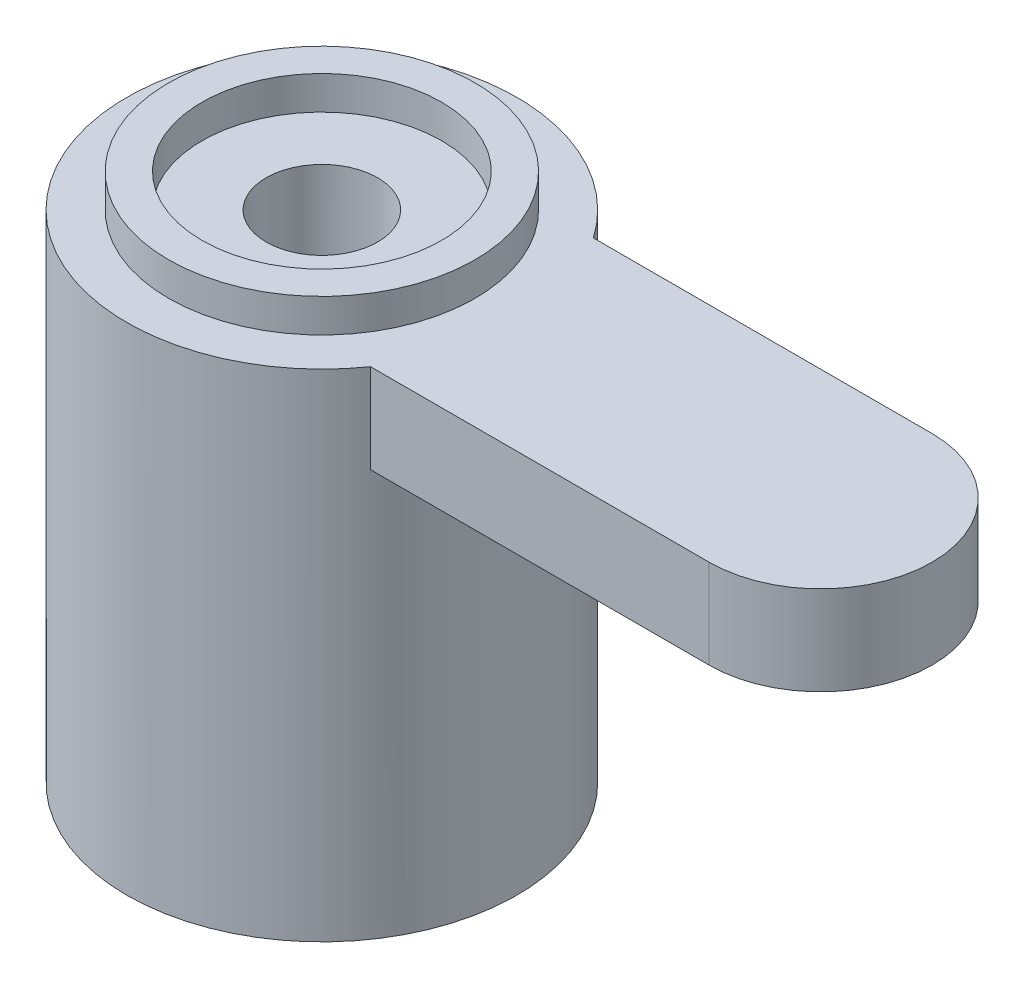
ISO-10303-21;
HEADER;
FILE_DESCRIPTION(('STEP AP214'),'2;1');
FILE_NAME('part.step','',(''),(''),'','','');
FILE_SCHEMA(('AUTOMOTIVE_DESIGN { 1 0 10303 214 1 1 1 1 }'));
ENDSEC;
DATA;
#1=APPLICATION_CONTEXT('core data for automotive mechanical design processes');
#2=APPLICATION_PROTOCOL_DEFINITION('international standard','automotive_design',2000,#1);
#3=PRODUCT_CONTEXT('',#1,'mechanical');
#4=PRODUCT('Part','Part','',(#3));
#5=PRODUCT_RELATED_PRODUCT_CATEGORY('part','',(#4));
#6=PRODUCT_DEFINITION_FORMATION('','',#4);
#7=PRODUCT_DEFINITION_CONTEXT('part definition',#1,'design');
#8=PRODUCT_DEFINITION('design','',#6,#7);
#9=PRODUCT_DEFINITION_SHAPE('','',#8);
#10=(LENGTH_UNIT() NAMED_UNIT(*) SI_UNIT(.MILLI.,.METRE.));
#11=(NAMED_UNIT(*) PLANE_ANGLE_UNIT() SI_UNIT($,.RADIAN.));
#12=(NAMED_UNIT(*) SI_UNIT($,.STERADIAN.) SOLID_ANGLE_UNIT());
#13=UNCERTAINTY_MEASURE_WITH_UNIT(LENGTH_MEASURE(1.E-05),#10,'distance_accuracy_value','');
#14=(GEOMETRIC_REPRESENTATION_CONTEXT(3) GLOBAL_UNCERTAINTY_ASSIGNED_CONTEXT((#13)) GLOBAL_UNIT_ASSIGNED_CONTEXT((#10,
#11,#12)) REPRESENTATION_CONTEXT('',''));
#15=CARTESIAN_POINT('',(0.,0.,0.));
#16=DIRECTION('',(0.,0.,1.));
#17=DIRECTION('',(1.,0.,0.));
#18=AXIS2_PLACEMENT_3D('',#15,#16,#17);
#19=CARTESIAN_POINT('',(0.,9.5,0.));
#20=DIRECTION('',(0.,-1.,0.));
#21=DIRECTION('',(0.,0.,-1.));
#22=AXIS2_PLACEMENT_3D('',#19,#20,#21);
#23=CYLINDRICAL_SURFACE('',#22,3.5);
#24=CARTESIAN_POINT('',(0.,8.9,0.));
#25=DIRECTION('',(0.,1.,0.));
#26=DIRECTION('',(0.,0.,1.));
#27=AXIS2_PLACEMENT_3D('',#24,#25,#26);
#28=CIRCLE('',#27,3.5);
#29=CARTESIAN_POINT('',(2.87228132326901,8.9,2.));
#30=VERTEX_POINT('',#29);
#31=CARTESIAN_POINT('',(2.87228132326901,8.9,-2.));
#32=VERTEX_POINT('',#31);
#33=EDGE_CURVE('E71',#30,#32,#28,.F.);
#34=ORIENTED_EDGE('',*,*,#33,.T.);
#35=DIRECTION('',(0.,-1.,0.));
#36=VECTOR('',#35,1.);
#37=CARTESIAN_POINT('',(2.87228132326901,9.5,-2.));
#38=LINE('',#37,#36);
#39=CARTESIAN_POINT('',(2.87228132326901,7.3,-2.));
#40=VERTEX_POINT('',#39);
#41=EDGE_CURVE('E75',#40,#32,#38,.F.);
#42=ORIENTED_EDGE('',*,*,#41,.F.);
#43=CARTESIAN_POINT('',(0.,7.3,0.));
#44=DIRECTION('',(0.,1.,0.));
#45=DIRECTION('',(0.,0.,1.));
#46=AXIS2_PLACEMENT_3D('',#43,#44,#45);
#47=CIRCLE('',#46,3.5);
#48=CARTESIAN_POINT('',(2.87228132326901,7.3,2.));
#49=VERTEX_POINT('',#48);
#50=EDGE_CURVE('E11',#49,#40,#47,.T.);
#51=ORIENTED_EDGE('',*,*,#50,.F.);
#52=DIRECTION('',(0.,-1.,0.));
#53=VECTOR('',#52,1.);
#54=CARTESIAN_POINT('',(2.87228132326901,9.5,2.));
#55=LINE('',#54,#53);
#56=EDGE_CURVE('E41',#49,#30,#55,.F.);
#57=ORIENTED_EDGE('',*,*,#56,.T.);
#58=EDGE_LOOP('',(#34,#42,#51,#57));
#59=FACE_BOUND('',#58,.T.);
#60=CARTESIAN_POINT('',(0.,0.,0.));
#61=DIRECTION('',(0.,1.,0.));
#62=DIRECTION('',(0.,0.,1.));
#63=AXIS2_PLACEMENT_3D('',#60,#61,#62);
#64=CIRCLE('',#63,3.5);
#65=CARTESIAN_POINT('',(0.,0.,3.5));
#66=VERTEX_POINT('',#65);
#67=EDGE_CURVE('E94',#66,#66,#64,.T.);
#68=ORIENTED_EDGE('',*,*,#67,.T.);
#69=EDGE_LOOP('',(#68));
#70=FACE_BOUND('',#69,.T.);
#71=ADVANCED_FACE('F34',(#59,#70),#23,.T.);
#72=CARTESIAN_POINT('',(0.,9.5,0.));
#73=DIRECTION('',(0.,1.,0.));
#74=DIRECTION('',(0.,0.,1.));
#75=AXIS2_PLACEMENT_3D('',#72,#73,#74);
#76=PLANE('',#75);
#77=CARTESIAN_POINT('',(0.,9.5,0.));
#78=DIRECTION('',(0.,1.,0.));
#79=DIRECTION('',(0.,0.,1.));
#80=AXIS2_PLACEMENT_3D('',#77,#78,#79);
#81=CIRCLE('',#80,2.15);
#82=CARTESIAN_POINT('',(0.,9.5,2.15));
#83=VERTEX_POINT('',#82);
#84=EDGE_CURVE('E120',#83,#83,#81,.T.);
#85=ORIENTED_EDGE('',*,*,#84,.F.);
#86=EDGE_LOOP('',(#85));
#87=FACE_BOUND('',#86,.T.);
#88=CARTESIAN_POINT('',(0.,9.5,0.));
#89=DIRECTION('',(0.,1.,0.));
#90=DIRECTION('',(0.,0.,1.));
#91=AXIS2_PLACEMENT_3D('',#88,#89,#90);
#92=CIRCLE('',#91,2.75);
#93=CARTESIAN_POINT('',(0.,9.5,2.75));
#94=VERTEX_POINT('',#93);
#95=EDGE_CURVE('E78',#94,#94,#92,.T.);
#96=ORIENTED_EDGE('',*,*,#95,.T.);
#97=EDGE_LOOP('',(#96));
#98=FACE_BOUND('',#97,.T.);
#99=ADVANCED_FACE('F134',(#87,#98),#76,.T.);
#100=CARTESIAN_POINT('',(0.,0.,0.));
#101=DIRECTION('',(0.,1.,0.));
#102=DIRECTION('',(0.,0.,1.));
#103=AXIS2_PLACEMENT_3D('',#100,#101,#102);
#104=PLANE('',#103);
#105=CARTESIAN_POINT('',(0.,0.,0.));
#106=DIRECTION('',(0.,-1.,0.));
#107=DIRECTION('',(0.,0.,-1.));
#108=AXIS2_PLACEMENT_3D('',#105,#106,#107);
#109=CIRCLE('',#108,1.9);
#110=CARTESIAN_POINT('',(0.,0.,-1.9));
#111=VERTEX_POINT('',#110);
#112=EDGE_CURVE('E100',#111,#111,#109,.T.);
#113=ORIENTED_EDGE('',*,*,#112,.F.);
#114=EDGE_LOOP('',(#113));
#115=FACE_BOUND('',#114,.T.);
#116=ORIENTED_EDGE('',*,*,#67,.F.);
#117=EDGE_LOOP('',(#116));
#118=FACE_BOUND('',#117,.T.);
#119=ADVANCED_FACE('F152',(#115,#118),#104,.F.);
#120=CARTESIAN_POINT('',(0.,3.5,0.));
#121=DIRECTION('',(0.,-1.,0.));
#122=DIRECTION('',(0.,0.,-1.));
#123=AXIS2_PLACEMENT_3D('',#120,#121,#122);
#124=CYLINDRICAL_SURFACE('',#123,1.9);
#125=CARTESIAN_POINT('',(0.,3.5,0.));
#126=DIRECTION('',(0.,-1.,0.));
#127=DIRECTION('',(0.,0.,-1.));
#128=AXIS2_PLACEMENT_3D('',#125,#126,#127);
#129=CIRCLE('',#128,1.9);
#130=CARTESIAN_POINT('',(0.,3.5,-1.9));
#131=VERTEX_POINT('',#130);
#132=EDGE_CURVE('E97',#131,#131,#129,.T.);
#133=ORIENTED_EDGE('',*,*,#132,.F.);
#134=EDGE_LOOP('',(#133));
#135=FACE_BOUND('',#134,.T.);
#136=ORIENTED_EDGE('',*,*,#112,.T.);
#137=EDGE_LOOP('',(#136));
#138=FACE_BOUND('',#137,.T.);
#139=ADVANCED_FACE('F158',(#135,#138),#124,.F.);
#140=CARTESIAN_POINT('',(0.,3.5,0.));
#141=DIRECTION('',(0.,-1.,0.));
#142=DIRECTION('',(0.,0.,-1.));
#143=AXIS2_PLACEMENT_3D('',#140,#141,#142);
#144=PLANE('',#143);
#145=CARTESIAN_POINT('',(0.,3.5,0.));
#146=DIRECTION('',(0.,-1.,0.));
#147=DIRECTION('',(0.,0.,-1.));
#148=AXIS2_PLACEMENT_3D('',#145,#146,#147);
#149=CIRCLE('',#148,1.);
#150=CARTESIAN_POINT('',(0.,3.5,-1.));
#151=VERTEX_POINT('',#150);
#152=EDGE_CURVE('E123',#151,#151,#149,.T.);
#153=ORIENTED_EDGE('',*,*,#152,.F.);
#154=EDGE_LOOP('',(#153));
#155=FACE_BOUND('',#154,.T.);
#156=ORIENTED_EDGE('',*,*,#132,.T.);
#157=EDGE_LOOP('',(#156));
#158=FACE_BOUND('',#157,.T.);
#159=ADVANCED_FACE('F164',(#155,#158),#144,.T.);
#160=CARTESIAN_POINT('',(0.,8.9,0.));
#161=DIRECTION('',(0.,1.,0.));
#162=DIRECTION('',(0.,0.,1.));
#163=AXIS2_PLACEMENT_3D('',#160,#161,#162);
#164=PLANE('',#163);
#165=DIRECTION('',(1.,0.,0.));
#166=VECTOR('',#165,1.);
#167=CARTESIAN_POINT('',(0.,8.9,-2.));
#168=LINE('',#167,#166);
#169=CARTESIAN_POINT('',(8.95,8.9,-2.));
#170=VERTEX_POINT('',#169);
#171=EDGE_CURVE('E81',#32,#170,#168,.T.);
#172=ORIENTED_EDGE('',*,*,#171,.F.);
#173=ORIENTED_EDGE('',*,*,#33,.F.);
#174=DIRECTION('',(1.,0.,0.));
#175=VECTOR('',#174,1.);
#176=CARTESIAN_POINT('',(0.,8.9,2.));
#177=LINE('',#176,#175);
#178=CARTESIAN_POINT('',(8.95,8.9,2.));
#179=VERTEX_POINT('',#178);
#180=EDGE_CURVE('E112',#30,#179,#177,.T.);
#181=ORIENTED_EDGE('',*,*,#180,.T.);
#182=CARTESIAN_POINT('',(8.95,8.9,0.));
#183=DIRECTION('',(0.,1.,0.));
#184=DIRECTION('',(0.,0.,1.));
#185=AXIS2_PLACEMENT_3D('',#182,#183,#184);
#186=CIRCLE('',#185,2.);
#187=EDGE_CURVE('E85',#179,#170,#186,.T.);
#188=ORIENTED_EDGE('',*,*,#187,.T.);
#189=EDGE_LOOP('',(#172,#173,#181,#188));
#190=FACE_BOUND('',#189,.T.);
#191=CARTESIAN_POINT('',(0.,8.9,0.));
#192=DIRECTION('',(0.,1.,0.));
#193=DIRECTION('',(0.,0.,1.));
#194=AXIS2_PLACEMENT_3D('',#191,#192,#193);
#195=CIRCLE('',#194,2.75);
#196=CARTESIAN_POINT('',(0.,8.9,2.75));
#197=VERTEX_POINT('',#196);
#198=EDGE_CURVE('E77',#197,#197,#195,.F.);
#199=ORIENTED_EDGE('',*,*,#198,.T.);
#200=EDGE_LOOP('',(#199));
#201=FACE_BOUND('',#200,.T.);
#202=ADVANCED_FACE('F82',(#190,#201),#164,.T.);
#203=CARTESIAN_POINT('',(0.,7.3,2.));
#204=DIRECTION('',(0.,0.,1.));
#205=DIRECTION('',(1.,0.,0.));
#206=AXIS2_PLACEMENT_3D('',#203,#204,#205);
#207=PLANE('',#206);
#208=ORIENTED_EDGE('',*,*,#56,.F.);
#209=DIRECTION('',(1.,0.,0.));
#210=VECTOR('',#209,1.);
#211=CARTESIAN_POINT('',(0.,7.3,2.));
#212=LINE('',#211,#210);
#213=CARTESIAN_POINT('',(8.95,7.3,2.));
#214=VERTEX_POINT('',#213);
#215=EDGE_CURVE('E105',#49,#214,#212,.T.);
#216=ORIENTED_EDGE('',*,*,#215,.T.);
#217=DIRECTION('',(0.,1.,0.));
#218=VECTOR('',#217,1.);
#219=CARTESIAN_POINT('',(8.95,7.3,2.));
#220=LINE('',#219,#218);
#221=EDGE_CURVE('E90',#214,#179,#220,.T.);
#222=ORIENTED_EDGE('',*,*,#221,.T.);
#223=ORIENTED_EDGE('',*,*,#180,.F.);
#224=EDGE_LOOP('',(#208,#216,#222,#223));
#225=FACE_BOUND('',#224,.T.);
#226=ADVANCED_FACE('F171',(#225),#207,.T.);
#227=CARTESIAN_POINT('',(0.,7.3,-2.));
#228=DIRECTION('',(0.,0.,1.));
#229=DIRECTION('',(1.,0.,0.));
#230=AXIS2_PLACEMENT_3D('',#227,#228,#229);
#231=PLANE('',#230);
#232=DIRECTION('',(1.,0.,0.));
#233=VECTOR('',#232,1.);
#234=CARTESIAN_POINT('',(0.,7.3,-2.));
#235=LINE('',#234,#233);
#236=CARTESIAN_POINT('',(8.95,7.3,-2.));
#237=VERTEX_POINT('',#236);
#238=EDGE_CURVE('E93',#40,#237,#235,.T.);
#239=ORIENTED_EDGE('',*,*,#238,.F.);
#240=ORIENTED_EDGE('',*,*,#41,.T.);
#241=ORIENTED_EDGE('',*,*,#171,.T.);
#242=DIRECTION('',(0.,1.,0.));
#243=VECTOR('',#242,1.);
#244=CARTESIAN_POINT('',(8.95,7.3,-2.));
#245=LINE('',#244,#243);
#246=EDGE_CURVE('E110',#237,#170,#245,.T.);
#247=ORIENTED_EDGE('',*,*,#246,.F.);
#248=EDGE_LOOP('',(#239,#240,#241,#247));
#249=FACE_BOUND('',#248,.T.);
#250=ADVANCED_FACE('F92',(#249),#231,.F.);
#251=CARTESIAN_POINT('',(8.95,7.3,0.));
#252=DIRECTION('',(0.,1.,0.));
#253=DIRECTION('',(0.,0.,1.));
#254=AXIS2_PLACEMENT_3D('',#251,#252,#253);
#255=CYLINDRICAL_SURFACE('',#254,2.);
#256=ORIENTED_EDGE('',*,*,#187,.F.);
#257=ORIENTED_EDGE('',*,*,#221,.F.);
#258=CARTESIAN_POINT('',(8.95,7.3,0.));
#259=DIRECTION('',(0.,1.,0.));
#260=DIRECTION('',(0.,0.,1.));
#261=AXIS2_PLACEMENT_3D('',#258,#259,#260);
#262=CIRCLE('',#261,2.);
#263=EDGE_CURVE('E89',#214,#237,#262,.T.);
#264=ORIENTED_EDGE('',*,*,#263,.T.);
#265=ORIENTED_EDGE('',*,*,#246,.T.);
#266=EDGE_LOOP('',(#256,#257,#264,#265));
#267=FACE_BOUND('',#266,.T.);
#268=ADVANCED_FACE('F176',(#267),#255,.T.);
#269=CARTESIAN_POINT('',(0.,7.3,0.));
#270=DIRECTION('',(0.,1.,0.));
#271=DIRECTION('',(0.,0.,1.));
#272=AXIS2_PLACEMENT_3D('',#269,#270,#271);
#273=PLANE('',#272);
#274=ORIENTED_EDGE('',*,*,#215,.F.);
#275=ORIENTED_EDGE('',*,*,#50,.T.);
#276=ORIENTED_EDGE('',*,*,#238,.T.);
#277=ORIENTED_EDGE('',*,*,#263,.F.);
#278=EDGE_LOOP('',(#274,#275,#276,#277));
#279=FACE_BOUND('',#278,.T.);
#280=ADVANCED_FACE('F172',(#279),#273,.F.);
#281=CARTESIAN_POINT('',(0.,2.81888168179569,0.));
#282=DIRECTION('',(0.,1.,0.));
#283=DIRECTION('',(0.,0.,1.));
#284=AXIS2_PLACEMENT_3D('',#281,#282,#283);
#285=CYLINDRICAL_SURFACE('',#284,2.15);
#286=CARTESIAN_POINT('',(0.,8.9,0.));
#287=DIRECTION('',(0.,1.,0.));
#288=DIRECTION('',(0.,0.,1.));
#289=AXIS2_PLACEMENT_3D('',#286,#287,#288);
#290=CIRCLE('',#289,2.15);
#291=CARTESIAN_POINT('',(0.,8.9,2.15));
#292=VERTEX_POINT('',#291);
#293=EDGE_CURVE('E107',#292,#292,#290,.F.);
#294=ORIENTED_EDGE('',*,*,#293,.T.);
#295=EDGE_LOOP('',(#294));
#296=FACE_BOUND('',#295,.T.);
#297=ORIENTED_EDGE('',*,*,#84,.T.);
#298=EDGE_LOOP('',(#297));
#299=FACE_BOUND('',#298,.T.);
#300=ADVANCED_FACE('F175',(#296,#299),#285,.F.);
#301=CARTESIAN_POINT('',(0.,8.9,0.));
#302=DIRECTION('',(0.,1.,0.));
#303=DIRECTION('',(0.,0.,1.));
#304=AXIS2_PLACEMENT_3D('',#301,#302,#303);
#305=PLANE('',#304);
#306=CARTESIAN_POINT('',(0.,8.9,0.));
#307=DIRECTION('',(0.,1.,0.));
#308=DIRECTION('',(0.,0.,1.));
#309=AXIS2_PLACEMENT_3D('',#306,#307,#308);
#310=CIRCLE('',#309,1.);
#311=CARTESIAN_POINT('',(0.,8.9,1.));
#312=VERTEX_POINT('',#311);
#313=EDGE_CURVE('E126',#312,#312,#310,.T.);
#314=ORIENTED_EDGE('',*,*,#313,.F.);
#315=EDGE_LOOP('',(#314));
#316=FACE_BOUND('',#315,.T.);
#317=ORIENTED_EDGE('',*,*,#293,.F.);
#318=EDGE_LOOP('',(#317));
#319=FACE_BOUND('',#318,.T.);
#320=ADVANCED_FACE('F144',(#316,#319),#305,.T.);
#321=CARTESIAN_POINT('',(0.,-22.7,0.));
#322=DIRECTION('',(0.,1.,0.));
#323=DIRECTION('',(0.,0.,1.));
#324=AXIS2_PLACEMENT_3D('',#321,#322,#323);
#325=CYLINDRICAL_SURFACE('',#324,1.);
#326=ORIENTED_EDGE('',*,*,#152,.T.);
#327=EDGE_LOOP('',(#326));
#328=FACE_BOUND('',#327,.T.);
#329=ORIENTED_EDGE('',*,*,#313,.T.);
#330=EDGE_LOOP('',(#329));
#331=FACE_BOUND('',#330,.T.);
#332=ADVANCED_FACE('F138',(#328,#331),#325,.F.);
#333=CARTESIAN_POINT('',(0.,-0.999494936611667,0.));
#334=DIRECTION('',(0.,1.,0.));
#335=DIRECTION('',(0.,0.,1.));
#336=AXIS2_PLACEMENT_3D('',#333,#334,#335);
#337=CYLINDRICAL_SURFACE('',#336,2.75);
#338=ORIENTED_EDGE('',*,*,#198,.F.);
#339=EDGE_LOOP('',(#338));
#340=FACE_BOUND('',#339,.T.);
#341=ORIENTED_EDGE('',*,*,#95,.F.);
#342=EDGE_LOOP('',(#341));
#343=FACE_BOUND('',#342,.T.);
#344=ADVANCED_FACE('F136',(#340,#343),#337,.T.);
#345=CLOSED_SHELL('',(#71,#99,#119,#139,#159,#202,#226,#250,#268,#280,#300,#320,#332,#344));
#346=MANIFOLD_SOLID_BREP('B2',#345);
#347=ADVANCED_BREP_SHAPE_REPRESENTATION('',(#18,#346),#14);
#348=SHAPE_DEFINITION_REPRESENTATION(#9,#347);
ENDSEC;
END-ISO-10303-21;
